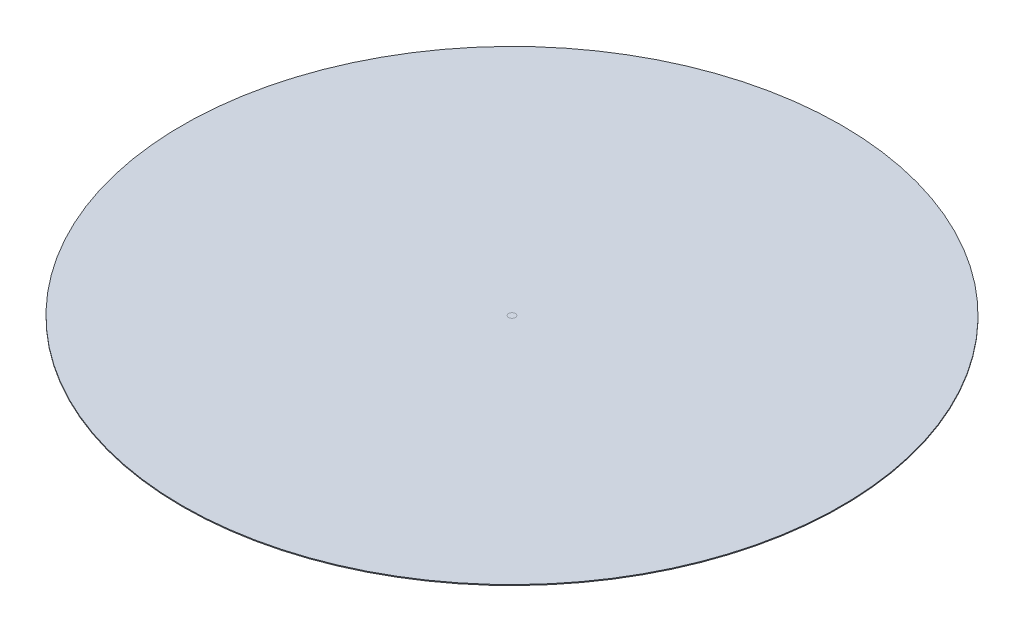
ISO-10303-21;
HEADER;
FILE_DESCRIPTION(('STEP AP214'),'2;1');
FILE_NAME('part.step','',(''),(''),'','','');
FILE_SCHEMA(('AUTOMOTIVE_DESIGN { 1 0 10303 214 1 1 1 1 }'));
ENDSEC;
DATA;
#1=APPLICATION_CONTEXT('core data for automotive mechanical design processes');
#2=APPLICATION_PROTOCOL_DEFINITION('international standard','automotive_design',2000,#1);
#3=PRODUCT_CONTEXT('',#1,'mechanical');
#4=PRODUCT('Part','Part','',(#3));
#5=PRODUCT_RELATED_PRODUCT_CATEGORY('part','',(#4));
#6=PRODUCT_DEFINITION_FORMATION('','',#4);
#7=PRODUCT_DEFINITION_CONTEXT('part definition',#1,'design');
#8=PRODUCT_DEFINITION('design','',#6,#7);
#9=PRODUCT_DEFINITION_SHAPE('','',#8);
#10=(LENGTH_UNIT() NAMED_UNIT(*) SI_UNIT(.MILLI.,.METRE.));
#11=(NAMED_UNIT(*) PLANE_ANGLE_UNIT() SI_UNIT($,.RADIAN.));
#12=(NAMED_UNIT(*) SI_UNIT($,.STERADIAN.) SOLID_ANGLE_UNIT());
#13=UNCERTAINTY_MEASURE_WITH_UNIT(LENGTH_MEASURE(1.E-05),#10,'distance_accuracy_value','');
#14=(GEOMETRIC_REPRESENTATION_CONTEXT(3) GLOBAL_UNCERTAINTY_ASSIGNED_CONTEXT((#13)) GLOBAL_UNIT_ASSIGNED_CONTEXT((#10,
#11,#12)) REPRESENTATION_CONTEXT('',''));
#15=CARTESIAN_POINT('',(0.,0.,0.));
#16=DIRECTION('',(0.,0.,1.));
#17=DIRECTION('',(1.,0.,0.));
#18=AXIS2_PLACEMENT_3D('',#15,#16,#17);
#19=CARTESIAN_POINT('',(0.,0.0254,0.));
#20=DIRECTION('',(0.,1.,0.));
#21=DIRECTION('',(0.,0.,1.));
#22=AXIS2_PLACEMENT_3D('',#19,#20,#21);
#23=PLANE('',#22);
#24=CARTESIAN_POINT('',(0.,0.0254,0.));
#25=DIRECTION('',(0.,1.,0.));
#26=DIRECTION('',(0.,0.,1.));
#27=AXIS2_PLACEMENT_3D('',#24,#25,#26);
#28=CIRCLE('',#27,9.525);
#29=CARTESIAN_POINT('',(0.,0.0254,9.525));
#30=VERTEX_POINT('',#29);
#31=EDGE_CURVE('E45',#30,#30,#28,.T.);
#32=ORIENTED_EDGE('',*,*,#31,.T.);
#33=EDGE_LOOP('',(#32));
#34=FACE_BOUND('',#33,.T.);
#35=CARTESIAN_POINT('',(0.,0.0254,0.));
#36=DIRECTION('',(0.,1.,0.));
#37=DIRECTION('',(0.,0.,1.));
#38=AXIS2_PLACEMENT_3D('',#35,#36,#37);
#39=CIRCLE('',#38,0.1);
#40=CARTESIAN_POINT('',(0.,0.0254,0.1));
#41=VERTEX_POINT('',#40);
#42=EDGE_CURVE('E10',#41,#41,#39,.F.);
#43=ORIENTED_EDGE('',*,*,#42,.T.);
#44=EDGE_LOOP('',(#43));
#45=FACE_BOUND('',#44,.T.);
#46=ADVANCED_FACE('F37',(#34,#45),#23,.T.);
#47=CARTESIAN_POINT('',(0.,0.0254,0.));
#48=DIRECTION('',(0.,-1.,0.));
#49=DIRECTION('',(0.,0.,-1.));
#50=AXIS2_PLACEMENT_3D('',#47,#48,#49);
#51=CYLINDRICAL_SURFACE('',#50,9.525);
#52=ORIENTED_EDGE('',*,*,#31,.F.);
#53=EDGE_LOOP('',(#52));
#54=FACE_BOUND('',#53,.T.);
#55=CARTESIAN_POINT('',(0.,0.,0.));
#56=DIRECTION('',(0.,1.,0.));
#57=DIRECTION('',(0.,0.,1.));
#58=AXIS2_PLACEMENT_3D('',#55,#56,#57);
#59=CIRCLE('',#58,9.525);
#60=CARTESIAN_POINT('',(0.,0.,9.525));
#61=VERTEX_POINT('',#60);
#62=EDGE_CURVE('E51',#61,#61,#59,.T.);
#63=ORIENTED_EDGE('',*,*,#62,.T.);
#64=EDGE_LOOP('',(#63));
#65=FACE_BOUND('',#64,.T.);
#66=ADVANCED_FACE('F39',(#54,#65),#51,.T.);
#67=ORIENTED_EDGE('',*,*,#42,.F.);
#68=EDGE_LOOP('',(#67));
#69=FACE_BOUND('',#68,.T.);
#70=ADVANCED_FACE('F61',(#69),#23,.T.);
#71=CARTESIAN_POINT('',(0.,0.,0.));
#72=DIRECTION('',(0.,1.,0.));
#73=DIRECTION('',(0.,0.,1.));
#74=AXIS2_PLACEMENT_3D('',#71,#72,#73);
#75=PLANE('',#74);
#76=ORIENTED_EDGE('',*,*,#62,.F.);
#77=EDGE_LOOP('',(#76));
#78=FACE_BOUND('',#77,.T.);
#79=ADVANCED_FACE('F59',(#78),#75,.F.);
#80=CLOSED_SHELL('',(#46,#66,#70,#79));
#81=MANIFOLD_SOLID_BREP('B2',#80);
#82=ADVANCED_BREP_SHAPE_REPRESENTATION('',(#18,#81),#14);
#83=SHAPE_DEFINITION_REPRESENTATION(#9,#82);
ENDSEC;
END-ISO-10303-21;
